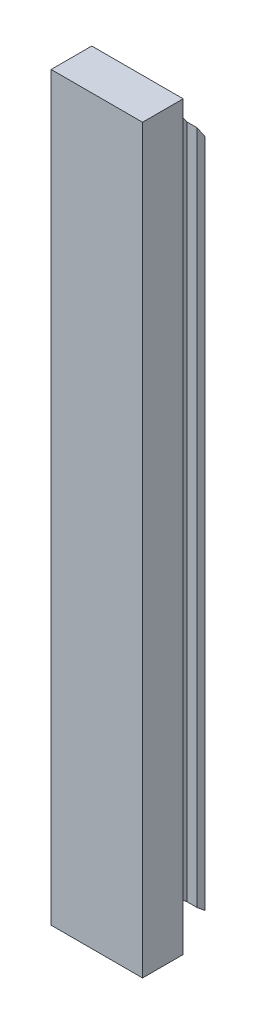
ISO-10303-21;
HEADER;
FILE_DESCRIPTION(('STEP AP214'),'2;1');
FILE_NAME('part.step','',(''),(''),'','','');
FILE_SCHEMA(('AUTOMOTIVE_DESIGN { 1 0 10303 214 1 1 1 1 }'));
ENDSEC;
DATA;
#1=APPLICATION_CONTEXT('core data for automotive mechanical design processes');
#2=APPLICATION_PROTOCOL_DEFINITION('international standard','automotive_design',2000,#1);
#3=PRODUCT_CONTEXT('',#1,'mechanical');
#4=PRODUCT('Part','Part','',(#3));
#5=PRODUCT_RELATED_PRODUCT_CATEGORY('part','',(#4));
#6=PRODUCT_DEFINITION_FORMATION('','',#4);
#7=PRODUCT_DEFINITION_CONTEXT('part definition',#1,'design');
#8=PRODUCT_DEFINITION('design','',#6,#7);
#9=PRODUCT_DEFINITION_SHAPE('','',#8);
#10=(LENGTH_UNIT() NAMED_UNIT(*) SI_UNIT(.MILLI.,.METRE.));
#11=(NAMED_UNIT(*) PLANE_ANGLE_UNIT() SI_UNIT($,.RADIAN.));
#12=(NAMED_UNIT(*) SI_UNIT($,.STERADIAN.) SOLID_ANGLE_UNIT());
#13=UNCERTAINTY_MEASURE_WITH_UNIT(LENGTH_MEASURE(1.E-05),#10,'distance_accuracy_value','');
#14=(GEOMETRIC_REPRESENTATION_CONTEXT(3) GLOBAL_UNCERTAINTY_ASSIGNED_CONTEXT((#13)) GLOBAL_UNIT_ASSIGNED_CONTEXT((#10,
#11,#12)) REPRESENTATION_CONTEXT('',''));
#15=CARTESIAN_POINT('',(0.,0.,0.));
#16=DIRECTION('',(0.,0.,1.));
#17=DIRECTION('',(1.,0.,0.));
#18=AXIS2_PLACEMENT_3D('',#15,#16,#17);
#19=CARTESIAN_POINT('',(0.,0.634730513202272,0.772733573497348));
#20=DIRECTION('',(0.,0.,-1.));
#21=DIRECTION('',(-1.,0.,0.));
#22=AXIS2_PLACEMENT_3D('',#19,#20,#21);
#23=PLANE('',#22);
#24=DIRECTION('',(0.,-1.,0.));
#25=VECTOR('',#24,1.);
#26=CARTESIAN_POINT('',(-1.,-32.3652694868031,0.772733573497348));
#27=LINE('',#26,#25);
#28=CARTESIAN_POINT('',(-1.,34.1293944186559,0.772733573497348));
#29=VERTEX_POINT('',#28);
#30=CARTESIAN_POINT('',(-1.,-32.3652694867981,0.772733573497348));
#31=VERTEX_POINT('',#30);
#32=EDGE_CURVE('E209',#29,#31,#27,.T.);
#33=ORIENTED_EDGE('',*,*,#32,.F.);
#34=DIRECTION('',(1.,0.,0.));
#35=VECTOR('',#34,1.);
#36=CARTESIAN_POINT('',(-2.00000000000003,34.1293944186559,0.772733573497345));
#37=LINE('',#36,#35);
#38=CARTESIAN_POINT('',(-2.00000000000003,34.1293944186559,0.772733573497345));
#39=VERTEX_POINT('',#38);
#40=EDGE_CURVE('E235',#39,#29,#37,.T.);
#41=ORIENTED_EDGE('',*,*,#40,.F.);
#42=DIRECTION('',(0.,-1.,0.));
#43=VECTOR('',#42,1.);
#44=CARTESIAN_POINT('',(-2.00000000000003,-32.3652694867981,0.772733573497348));
#45=LINE('',#44,#43);
#46=CARTESIAN_POINT('',(-2.00000000000003,-32.3652694867981,0.772733573497348));
#47=VERTEX_POINT('',#46);
#48=EDGE_CURVE('E252',#39,#47,#45,.T.);
#49=ORIENTED_EDGE('',*,*,#48,.T.);
#50=DIRECTION('',(1.,0.,0.));
#51=VECTOR('',#50,1.);
#52=CARTESIAN_POINT('',(-2.00000000000003,-32.3652694867981,0.772733573497348));
#53=LINE('',#52,#51);
#54=EDGE_CURVE('E64',#47,#31,#53,.T.);
#55=ORIENTED_EDGE('',*,*,#54,.T.);
#56=EDGE_LOOP('',(#33,#41,#49,#55));
#57=FACE_BOUND('',#56,.T.);
#58=ADVANCED_FACE('F39',(#57),#23,.F.);
#59=DIRECTION('',(0.,1.,0.));
#60=VECTOR('',#59,1.);
#61=CARTESIAN_POINT('',(1.,-32.3652694868031,0.772733573497348));
#62=LINE('',#61,#60);
#63=CARTESIAN_POINT('',(1.,-32.3652694867981,0.772733573497348));
#64=VERTEX_POINT('',#63);
#65=CARTESIAN_POINT('',(1.,34.1293944186559,0.772733573497348));
#66=VERTEX_POINT('',#65);
#67=EDGE_CURVE('E56',#64,#66,#62,.T.);
#68=ORIENTED_EDGE('',*,*,#67,.F.);
#69=CARTESIAN_POINT('',(1.99999999999997,-32.3652694867981,0.772733573497348));
#70=VERTEX_POINT('',#69);
#71=EDGE_CURVE('E256',#64,#70,#53,.T.);
#72=ORIENTED_EDGE('',*,*,#71,.T.);
#73=DIRECTION('',(0.,1.,0.));
#74=VECTOR('',#73,1.);
#75=CARTESIAN_POINT('',(1.99999999999997,-32.3652694867981,0.772733573497348));
#76=LINE('',#75,#74);
#77=CARTESIAN_POINT('',(1.99999999999997,34.1293944186559,0.772733573497345));
#78=VERTEX_POINT('',#77);
#79=EDGE_CURVE('E248',#70,#78,#76,.T.);
#80=ORIENTED_EDGE('',*,*,#79,.T.);
#81=EDGE_CURVE('E240',#66,#78,#37,.T.);
#82=ORIENTED_EDGE('',*,*,#81,.F.);
#83=EDGE_LOOP('',(#68,#72,#80,#82));
#84=FACE_BOUND('',#83,.T.);
#85=ADVANCED_FACE('F287',(#84),#23,.F.);
#86=CARTESIAN_POINT('',(1.99999999999997,-32.3652694867981,0.772733573497348));
#87=DIRECTION('',(-1.,0.,0.));
#88=DIRECTION('',(0.,0.,1.));
#89=AXIS2_PLACEMENT_3D('',#86,#87,#88);
#90=PLANE('',#89);
#91=DIRECTION('',(0.,-0.825310658693003,-0.564678950066072));
#92=VECTOR('',#91,1.);
#93=CARTESIAN_POINT('',(1.99999999999997,109.734509075153,52.5018810335164));
#94=LINE('',#93,#92);
#95=CARTESIAN_POINT('',(1.99999999999997,32.9999999999997,0.));
#96=VERTEX_POINT('',#95);
#97=EDGE_CURVE('E244',#78,#96,#94,.T.);
#98=ORIENTED_EDGE('',*,*,#97,.F.);
#99=ORIENTED_EDGE('',*,*,#79,.F.);
#100=DIRECTION('',(0.,-0.634730513202272,-0.772733573497348));
#101=VECTOR('',#100,1.);
#102=CARTESIAN_POINT('',(1.99999999999997,-32.3652694867981,0.772733573497348));
#103=LINE('',#102,#101);
#104=CARTESIAN_POINT('',(1.99999999999997,-33.0000000000004,0.));
#105=VERTEX_POINT('',#104);
#106=EDGE_CURVE('E49',#70,#105,#103,.T.);
#107=ORIENTED_EDGE('',*,*,#106,.T.);
#108=DIRECTION('',(0.,1.,0.));
#109=VECTOR('',#108,1.);
#110=CARTESIAN_POINT('',(1.99999999999997,-33.0000000000004,0.));
#111=LINE('',#110,#109);
#112=EDGE_CURVE('E239',#105,#96,#111,.T.);
#113=ORIENTED_EDGE('',*,*,#112,.T.);
#114=EDGE_LOOP('',(#98,#99,#107,#113));
#115=FACE_BOUND('',#114,.T.);
#116=ADVANCED_FACE('F41',(#115),#90,.F.);
#117=CARTESIAN_POINT('',(-2.00000000000003,-32.3652694867981,0.772733573497348));
#118=DIRECTION('',(1.,0.,0.));
#119=DIRECTION('',(0.,0.,-1.));
#120=AXIS2_PLACEMENT_3D('',#117,#118,#119);
#121=PLANE('',#120);
#122=DIRECTION('',(0.,-1.,0.));
#123=VECTOR('',#122,1.);
#124=CARTESIAN_POINT('',(-2.00000000000003,-33.0000000000004,0.));
#125=LINE('',#124,#123);
#126=CARTESIAN_POINT('',(-2.00000000000003,32.9999999999997,0.));
#127=VERTEX_POINT('',#126);
#128=CARTESIAN_POINT('',(-2.00000000000003,-33.0000000000004,0.));
#129=VERTEX_POINT('',#128);
#130=EDGE_CURVE('E266',#127,#129,#125,.T.);
#131=ORIENTED_EDGE('',*,*,#130,.T.);
#132=DIRECTION('',(0.,-0.634730513202272,-0.772733573497348));
#133=VECTOR('',#132,1.);
#134=CARTESIAN_POINT('',(-2.00000000000003,-32.3652694867981,0.772733573497348));
#135=LINE('',#134,#133);
#136=EDGE_CURVE('E11',#47,#129,#135,.T.);
#137=ORIENTED_EDGE('',*,*,#136,.F.);
#138=ORIENTED_EDGE('',*,*,#48,.F.);
#139=DIRECTION('',(0.,-0.825310658693003,-0.564678950066072));
#140=VECTOR('',#139,1.);
#141=CARTESIAN_POINT('',(-2.00000000000003,109.734509075153,52.5018810335164));
#142=LINE('',#141,#140);
#143=EDGE_CURVE('E234',#39,#127,#142,.T.);
#144=ORIENTED_EDGE('',*,*,#143,.T.);
#145=EDGE_LOOP('',(#131,#137,#138,#144));
#146=FACE_BOUND('',#145,.T.);
#147=ADVANCED_FACE('F321',(#146),#121,.F.);
#148=CARTESIAN_POINT('',(-2.00000000000003,-32.3652694867981,0.772733573497348));
#149=DIRECTION('',(0.,0.772733573497348,-0.634730513202272));
#150=DIRECTION('',(0.,0.634730513202272,0.772733573497348));
#151=AXIS2_PLACEMENT_3D('',#148,#149,#150);
#152=PLANE('',#151);
#153=ORIENTED_EDGE('',*,*,#71,.F.);
#154=DIRECTION('',(0.,-0.634730513202272,-0.772733573497348));
#155=VECTOR('',#154,1.);
#156=CARTESIAN_POINT('',(1.,-29.1916169207917,4.63640144098409));
#157=LINE('',#156,#155);
#158=CARTESIAN_POINT('',(1.,-29.1916169207917,4.63640144098409));
#159=VERTEX_POINT('',#158);
#160=EDGE_CURVE('E222',#159,#64,#157,.T.);
#161=ORIENTED_EDGE('',*,*,#160,.F.);
#162=DIRECTION('',(1.,0.,0.));
#163=VECTOR('',#162,1.);
#164=CARTESIAN_POINT('',(-1.,-29.1916169207917,4.63640144098409));
#165=LINE('',#164,#163);
#166=CARTESIAN_POINT('',(-1.,-29.1916169207917,4.63640144098409));
#167=VERTEX_POINT('',#166);
#168=EDGE_CURVE('E214',#167,#159,#165,.T.);
#169=ORIENTED_EDGE('',*,*,#168,.F.);
#170=DIRECTION('',(0.,-0.634730513202272,-0.772733573497348));
#171=VECTOR('',#170,1.);
#172=CARTESIAN_POINT('',(-1.,-29.1916169207917,4.63640144098409));
#173=LINE('',#172,#171);
#174=EDGE_CURVE('E231',#167,#31,#173,.T.);
#175=ORIENTED_EDGE('',*,*,#174,.T.);
#176=ORIENTED_EDGE('',*,*,#54,.F.);
#177=ORIENTED_EDGE('',*,*,#136,.T.);
#178=DIRECTION('',(1.,0.,0.));
#179=VECTOR('',#178,1.);
#180=CARTESIAN_POINT('',(-2.00000000000003,-33.0000000000004,0.));
#181=LINE('',#180,#179);
#182=EDGE_CURVE('E253',#129,#105,#181,.T.);
#183=ORIENTED_EDGE('',*,*,#182,.T.);
#184=ORIENTED_EDGE('',*,*,#106,.F.);
#185=EDGE_LOOP('',(#153,#161,#169,#175,#176,#177,#183,#184));
#186=FACE_BOUND('',#185,.T.);
#187=ADVANCED_FACE('F319',(#186),#152,.F.);
#188=CARTESIAN_POINT('',(0.,0.,0.));
#189=DIRECTION('',(0.,0.,-1.));
#190=DIRECTION('',(-1.,0.,0.));
#191=AXIS2_PLACEMENT_3D('',#188,#189,#190);
#192=PLANE('',#191);
#193=ORIENTED_EDGE('',*,*,#112,.F.);
#194=ORIENTED_EDGE('',*,*,#182,.F.);
#195=ORIENTED_EDGE('',*,*,#130,.F.);
#196=DIRECTION('',(-1.,0.,0.));
#197=VECTOR('',#196,1.);
#198=CARTESIAN_POINT('',(-2.00000000000003,32.9999999999997,0.));
#199=LINE('',#198,#197);
#200=EDGE_CURVE('E262',#96,#127,#199,.T.);
#201=ORIENTED_EDGE('',*,*,#200,.F.);
#202=EDGE_LOOP('',(#193,#194,#195,#201));
#203=FACE_BOUND('',#202,.T.);
#204=ADVANCED_FACE('F281',(#203),#192,.T.);
#205=CARTESIAN_POINT('',(-2.00000000000003,109.734509075153,52.5018810335164));
#206=DIRECTION('',(0.,-0.564678950066072,0.825310658693003));
#207=DIRECTION('',(0.,-0.825310658693003,-0.564678950066072));
#208=AXIS2_PLACEMENT_3D('',#205,#206,#207);
#209=PLANE('',#208);
#210=ORIENTED_EDGE('',*,*,#143,.F.);
#211=ORIENTED_EDGE('',*,*,#40,.T.);
#212=DIRECTION('',(0.,-0.825310658693003,-0.564678950066072));
#213=VECTOR('',#212,1.);
#214=CARTESIAN_POINT('',(-1.,115.843009648841,56.6813274687422));
#215=LINE('',#214,#213);
#216=CARTESIAN_POINT('',(-1.,39.7763665119372,4.63640144098409));
#217=VERTEX_POINT('',#216);
#218=EDGE_CURVE('E200',#217,#29,#215,.T.);
#219=ORIENTED_EDGE('',*,*,#218,.F.);
#220=DIRECTION('',(1.,0.,0.));
#221=VECTOR('',#220,1.);
#222=CARTESIAN_POINT('',(-1.,39.7763665119372,4.63640144098409));
#223=LINE('',#222,#221);
#224=CARTESIAN_POINT('',(1.,39.7763665119372,4.63640144098409));
#225=VERTEX_POINT('',#224);
#226=EDGE_CURVE('E206',#217,#225,#223,.T.);
#227=ORIENTED_EDGE('',*,*,#226,.T.);
#228=DIRECTION('',(0.,-0.825310658693003,-0.564678950066072));
#229=VECTOR('',#228,1.);
#230=CARTESIAN_POINT('',(1.,115.843009648841,56.6813274687422));
#231=LINE('',#230,#229);
#232=EDGE_CURVE('E203',#225,#66,#231,.T.);
#233=ORIENTED_EDGE('',*,*,#232,.T.);
#234=ORIENTED_EDGE('',*,*,#81,.T.);
#235=ORIENTED_EDGE('',*,*,#97,.T.);
#236=ORIENTED_EDGE('',*,*,#200,.T.);
#237=EDGE_LOOP('',(#210,#211,#219,#227,#233,#234,#235,#236));
#238=FACE_BOUND('',#237,.T.);
#239=ADVANCED_FACE('F284',(#238),#209,.F.);
#240=CARTESIAN_POINT('',(-1.,-29.1916169207917,4.63640144098409));
#241=DIRECTION('',(1.,0.,0.));
#242=DIRECTION('',(0.,0.,-1.));
#243=AXIS2_PLACEMENT_3D('',#240,#241,#242);
#244=PLANE('',#243);
#245=CARTESIAN_POINT('',(-1.,-14.1916169207917,2.70456750724072));
#246=DIRECTION('',(-1.,0.,0.));
#247=DIRECTION('',(0.,0.,1.));
#248=AXIS2_PLACEMENT_3D('',#245,#246,#247);
#249=CIRCLE('',#248,1.49999999999999);
#250=CARTESIAN_POINT('',(-1.,-14.1916169207917,4.20456750724071));
#251=VERTEX_POINT('',#250);
#252=EDGE_CURVE('E182',#251,#251,#249,.T.);
#253=ORIENTED_EDGE('',*,*,#252,.F.);
#254=EDGE_LOOP('',(#253));
#255=FACE_BOUND('',#254,.T.);
#256=CARTESIAN_POINT('',(-1.,15.8083830792083,2.70456750724072));
#257=DIRECTION('',(-1.,0.,0.));
#258=DIRECTION('',(0.,0.,1.));
#259=AXIS2_PLACEMENT_3D('',#256,#257,#258);
#260=CIRCLE('',#259,1.49999999999999);
#261=CARTESIAN_POINT('',(-1.,15.8083830792083,4.20456750724071));
#262=VERTEX_POINT('',#261);
#263=EDGE_CURVE('E192',#262,#262,#260,.T.);
#264=ORIENTED_EDGE('',*,*,#263,.F.);
#265=EDGE_LOOP('',(#264));
#266=FACE_BOUND('',#265,.T.);
#267=ORIENTED_EDGE('',*,*,#32,.T.);
#268=ORIENTED_EDGE('',*,*,#174,.F.);
#269=DIRECTION('',(0.,-1.,0.));
#270=VECTOR('',#269,1.);
#271=CARTESIAN_POINT('',(-1.,-29.1916169207917,4.63640144098409));
#272=LINE('',#271,#270);
#273=EDGE_CURVE('E210',#217,#167,#272,.T.);
#274=ORIENTED_EDGE('',*,*,#273,.F.);
#275=ORIENTED_EDGE('',*,*,#218,.T.);
#276=EDGE_LOOP('',(#267,#268,#274,#275));
#277=FACE_BOUND('',#276,.T.);
#278=ADVANCED_FACE('F331',(#255,#266,#277),#244,.F.);
#279=CARTESIAN_POINT('',(1.,-29.1916169207917,4.63640144098409));
#280=DIRECTION('',(-1.,0.,0.));
#281=DIRECTION('',(0.,0.,1.));
#282=AXIS2_PLACEMENT_3D('',#279,#280,#281);
#283=PLANE('',#282);
#284=CARTESIAN_POINT('',(1.,-14.1916169207917,2.70456750724072));
#285=DIRECTION('',(-1.,0.,0.));
#286=DIRECTION('',(0.,0.,1.));
#287=AXIS2_PLACEMENT_3D('',#284,#285,#286);
#288=CIRCLE('',#287,1.49999999999999);
#289=CARTESIAN_POINT('',(1.,-14.1916169207917,4.20456750724072));
#290=VERTEX_POINT('',#289);
#291=EDGE_CURVE('E43',#290,#290,#288,.T.);
#292=ORIENTED_EDGE('',*,*,#291,.T.);
#293=EDGE_LOOP('',(#292));
#294=FACE_BOUND('',#293,.T.);
#295=CARTESIAN_POINT('',(1.,15.8083830792083,2.70456750724072));
#296=DIRECTION('',(-1.,0.,0.));
#297=DIRECTION('',(0.,0.,1.));
#298=AXIS2_PLACEMENT_3D('',#295,#296,#297);
#299=CIRCLE('',#298,1.49999999999999);
#300=CARTESIAN_POINT('',(1.,15.8083830792083,4.20456750724071));
#301=VERTEX_POINT('',#300);
#302=EDGE_CURVE('E196',#301,#301,#299,.T.);
#303=ORIENTED_EDGE('',*,*,#302,.T.);
#304=EDGE_LOOP('',(#303));
#305=FACE_BOUND('',#304,.T.);
#306=ORIENTED_EDGE('',*,*,#232,.F.);
#307=DIRECTION('',(0.,1.,0.));
#308=VECTOR('',#307,1.);
#309=CARTESIAN_POINT('',(1.,-29.1916169207917,4.63640144098409));
#310=LINE('',#309,#308);
#311=EDGE_CURVE('E218',#159,#225,#310,.T.);
#312=ORIENTED_EDGE('',*,*,#311,.F.);
#313=ORIENTED_EDGE('',*,*,#160,.T.);
#314=ORIENTED_EDGE('',*,*,#67,.T.);
#315=EDGE_LOOP('',(#306,#312,#313,#314));
#316=FACE_BOUND('',#315,.T.);
#317=ADVANCED_FACE('F293',(#294,#305,#316),#283,.F.);
#318=CARTESIAN_POINT('',(-1.,15.8083830792083,2.70456750724072));
#319=DIRECTION('',(-1.,0.,0.));
#320=DIRECTION('',(0.,0.,1.));
#321=AXIS2_PLACEMENT_3D('',#318,#319,#320);
#322=CYLINDRICAL_SURFACE('',#321,1.49999999999999);
#323=ORIENTED_EDGE('',*,*,#263,.T.);
#324=EDGE_LOOP('',(#323));
#325=FACE_BOUND('',#324,.T.);
#326=ORIENTED_EDGE('',*,*,#302,.F.);
#327=EDGE_LOOP('',(#326));
#328=FACE_BOUND('',#327,.T.);
#329=ADVANCED_FACE('F298',(#325,#328),#322,.F.);
#330=CARTESIAN_POINT('',(-1.,-14.1916169207917,2.70456750724072));
#331=DIRECTION('',(-1.,0.,0.));
#332=DIRECTION('',(0.,0.,1.));
#333=AXIS2_PLACEMENT_3D('',#330,#331,#332);
#334=CYLINDRICAL_SURFACE('',#333,1.49999999999999);
#335=ORIENTED_EDGE('',*,*,#252,.T.);
#336=EDGE_LOOP('',(#335));
#337=FACE_BOUND('',#336,.T.);
#338=ORIENTED_EDGE('',*,*,#291,.F.);
#339=EDGE_LOOP('',(#338));
#340=FACE_BOUND('',#339,.T.);
#341=ADVANCED_FACE('F296',(#337,#340),#334,.F.);
#342=CARTESIAN_POINT('',(-4.5,-33.1916169207917,8.63640144098409));
#343=DIRECTION('',(-1.,0.,0.));
#344=DIRECTION('',(0.,0.,1.));
#345=AXIS2_PLACEMENT_3D('',#342,#343,#344);
#346=PLANE('',#345);
#347=DIRECTION('',(0.,1.,0.));
#348=VECTOR('',#347,1.);
#349=CARTESIAN_POINT('',(-4.5,-33.1916169207917,4.63640144098409));
#350=LINE('',#349,#348);
#351=CARTESIAN_POINT('',(-4.5,-33.1916169207917,4.63640144098409));
#352=VERTEX_POINT('',#351);
#353=CARTESIAN_POINT('',(-4.5,39.7763665119372,4.63640144098409));
#354=VERTEX_POINT('',#353);
#355=EDGE_CURVE('E171',#352,#354,#350,.T.);
#356=ORIENTED_EDGE('',*,*,#355,.F.);
#357=DIRECTION('',(0.,0.,-1.));
#358=VECTOR('',#357,1.);
#359=CARTESIAN_POINT('',(-4.5,-33.1916169207917,8.63640144098409));
#360=LINE('',#359,#358);
#361=CARTESIAN_POINT('',(-4.5,-33.1916169207917,8.63640144098409));
#362=VERTEX_POINT('',#361);
#363=EDGE_CURVE('E158',#362,#352,#360,.T.);
#364=ORIENTED_EDGE('',*,*,#363,.F.);
#365=DIRECTION('',(0.,1.,0.));
#366=VECTOR('',#365,1.);
#367=CARTESIAN_POINT('',(-4.5,-33.1916169207917,8.63640144098409));
#368=LINE('',#367,#366);
#369=CARTESIAN_POINT('',(-4.5,39.7763665119372,8.63640144098409));
#370=VERTEX_POINT('',#369);
#371=EDGE_CURVE('E151',#362,#370,#368,.T.);
#372=ORIENTED_EDGE('',*,*,#371,.T.);
#373=DIRECTION('',(0.,0.,-1.));
#374=VECTOR('',#373,1.);
#375=CARTESIAN_POINT('',(-4.5,39.7763665119372,8.63640144098409));
#376=LINE('',#375,#374);
#377=EDGE_CURVE('E132',#370,#354,#376,.T.);
#378=ORIENTED_EDGE('',*,*,#377,.T.);
#379=EDGE_LOOP('',(#356,#364,#372,#378));
#380=FACE_BOUND('',#379,.T.);
#381=ADVANCED_FACE('F157',(#380),#346,.T.);
#382=CARTESIAN_POINT('',(-4.5,-33.1916169207917,8.63640144098409));
#383=DIRECTION('',(0.,1.,0.));
#384=DIRECTION('',(0.,0.,1.));
#385=AXIS2_PLACEMENT_3D('',#382,#383,#384);
#386=PLANE('',#385);
#387=DIRECTION('',(1.,0.,0.));
#388=VECTOR('',#387,1.);
#389=CARTESIAN_POINT('',(-4.5,-33.1916169207917,4.63640144098409));
#390=LINE('',#389,#388);
#391=CARTESIAN_POINT('',(4.5,-33.1916169207917,4.63640144098409));
#392=VERTEX_POINT('',#391);
#393=EDGE_CURVE('E161',#352,#392,#390,.T.);
#394=ORIENTED_EDGE('',*,*,#393,.T.);
#395=DIRECTION('',(0.,0.,-1.));
#396=VECTOR('',#395,1.);
#397=CARTESIAN_POINT('',(4.5,-33.1916169207917,8.63640144098409));
#398=LINE('',#397,#396);
#399=CARTESIAN_POINT('',(4.5,-33.1916169207917,8.63640144098409));
#400=VERTEX_POINT('',#399);
#401=EDGE_CURVE('E183',#400,#392,#398,.T.);
#402=ORIENTED_EDGE('',*,*,#401,.F.);
#403=DIRECTION('',(1.,0.,0.));
#404=VECTOR('',#403,1.);
#405=CARTESIAN_POINT('',(-4.5,-33.1916169207917,8.63640144098409));
#406=LINE('',#405,#404);
#407=EDGE_CURVE('E146',#362,#400,#406,.T.);
#408=ORIENTED_EDGE('',*,*,#407,.F.);
#409=ORIENTED_EDGE('',*,*,#363,.T.);
#410=EDGE_LOOP('',(#394,#402,#408,#409));
#411=FACE_BOUND('',#410,.T.);
#412=ADVANCED_FACE('F305',(#411),#386,.F.);
#413=CARTESIAN_POINT('',(4.5,-33.1916169207917,8.63640144098409));
#414=DIRECTION('',(-1.,0.,0.));
#415=DIRECTION('',(0.,0.,1.));
#416=AXIS2_PLACEMENT_3D('',#413,#414,#415);
#417=PLANE('',#416);
#418=DIRECTION('',(0.,1.,0.));
#419=VECTOR('',#418,1.);
#420=CARTESIAN_POINT('',(4.5,-33.1916169207917,4.63640144098409));
#421=LINE('',#420,#419);
#422=CARTESIAN_POINT('',(4.5,39.7763665119372,4.63640144098409));
#423=VERTEX_POINT('',#422);
#424=EDGE_CURVE('E164',#392,#423,#421,.T.);
#425=ORIENTED_EDGE('',*,*,#424,.T.);
#426=DIRECTION('',(0.,0.,-1.));
#427=VECTOR('',#426,1.);
#428=CARTESIAN_POINT('',(4.5,39.7763665119372,8.63640144098409));
#429=LINE('',#428,#427);
#430=CARTESIAN_POINT('',(4.5,39.7763665119372,8.63640144098409));
#431=VERTEX_POINT('',#430);
#432=EDGE_CURVE('E145',#431,#423,#429,.T.);
#433=ORIENTED_EDGE('',*,*,#432,.F.);
#434=DIRECTION('',(0.,1.,0.));
#435=VECTOR('',#434,1.);
#436=CARTESIAN_POINT('',(4.5,-33.1916169207917,8.63640144098409));
#437=LINE('',#436,#435);
#438=EDGE_CURVE('E153',#400,#431,#437,.T.);
#439=ORIENTED_EDGE('',*,*,#438,.F.);
#440=ORIENTED_EDGE('',*,*,#401,.T.);
#441=EDGE_LOOP('',(#425,#433,#439,#440));
#442=FACE_BOUND('',#441,.T.);
#443=ADVANCED_FACE('F342',(#442),#417,.F.);
#444=CARTESIAN_POINT('',(-4.5,39.7763665119372,8.63640144098409));
#445=DIRECTION('',(0.,1.,0.));
#446=DIRECTION('',(0.,0.,1.));
#447=AXIS2_PLACEMENT_3D('',#444,#445,#446);
#448=PLANE('',#447);
#449=DIRECTION('',(1.,0.,0.));
#450=VECTOR('',#449,1.);
#451=CARTESIAN_POINT('',(-4.5,39.7763665119372,4.63640144098409));
#452=LINE('',#451,#450);
#453=EDGE_CURVE('E139',#354,#217,#452,.T.);
#454=ORIENTED_EDGE('',*,*,#453,.F.);
#455=ORIENTED_EDGE('',*,*,#377,.F.);
#456=DIRECTION('',(1.,0.,0.));
#457=VECTOR('',#456,1.);
#458=CARTESIAN_POINT('',(-4.5,39.7763665119372,8.63640144098409));
#459=LINE('',#458,#457);
#460=EDGE_CURVE('E136',#370,#431,#459,.T.);
#461=ORIENTED_EDGE('',*,*,#460,.T.);
#462=ORIENTED_EDGE('',*,*,#432,.T.);
#463=EDGE_CURVE('E174',#225,#423,#452,.T.);
#464=ORIENTED_EDGE('',*,*,#463,.F.);
#465=ORIENTED_EDGE('',*,*,#226,.F.);
#466=EDGE_LOOP('',(#454,#455,#461,#462,#464,#465));
#467=FACE_BOUND('',#466,.T.);
#468=ADVANCED_FACE('F134',(#467),#448,.T.);
#469=CARTESIAN_POINT('',(0.,0.,8.63640144098409));
#470=DIRECTION('',(0.,0.,-1.));
#471=DIRECTION('',(-1.,0.,0.));
#472=AXIS2_PLACEMENT_3D('',#469,#470,#471);
#473=PLANE('',#472);
#474=ORIENTED_EDGE('',*,*,#371,.F.);
#475=ORIENTED_EDGE('',*,*,#407,.T.);
#476=ORIENTED_EDGE('',*,*,#438,.T.);
#477=ORIENTED_EDGE('',*,*,#460,.F.);
#478=EDGE_LOOP('',(#474,#475,#476,#477));
#479=FACE_BOUND('',#478,.T.);
#480=ADVANCED_FACE('F150',(#479),#473,.F.);
#481=CARTESIAN_POINT('',(0.,0.,4.63640144098409));
#482=DIRECTION('',(0.,0.,-1.));
#483=DIRECTION('',(-1.,0.,0.));
#484=AXIS2_PLACEMENT_3D('',#481,#482,#483);
#485=PLANE('',#484);
#486=ORIENTED_EDGE('',*,*,#453,.T.);
#487=ORIENTED_EDGE('',*,*,#273,.T.);
#488=ORIENTED_EDGE('',*,*,#168,.T.);
#489=ORIENTED_EDGE('',*,*,#311,.T.);
#490=ORIENTED_EDGE('',*,*,#463,.T.);
#491=ORIENTED_EDGE('',*,*,#424,.F.);
#492=ORIENTED_EDGE('',*,*,#393,.F.);
#493=ORIENTED_EDGE('',*,*,#355,.T.);
#494=EDGE_LOOP('',(#486,#487,#488,#489,#490,#491,#492,#493));
#495=FACE_BOUND('',#494,.T.);
#496=ADVANCED_FACE('F336',(#495),#485,.T.);
#497=CLOSED_SHELL('',(#58,#85,#116,#147,#187,#204,#239,#278,#317,#329,#341,#381,#412,#443,#468,
#480,#496));
#498=MANIFOLD_SOLID_BREP('B2',#497);
#499=ADVANCED_BREP_SHAPE_REPRESENTATION('',(#18,#498),#14);
#500=SHAPE_DEFINITION_REPRESENTATION(#9,#499);
ENDSEC;
END-ISO-10303-21;
